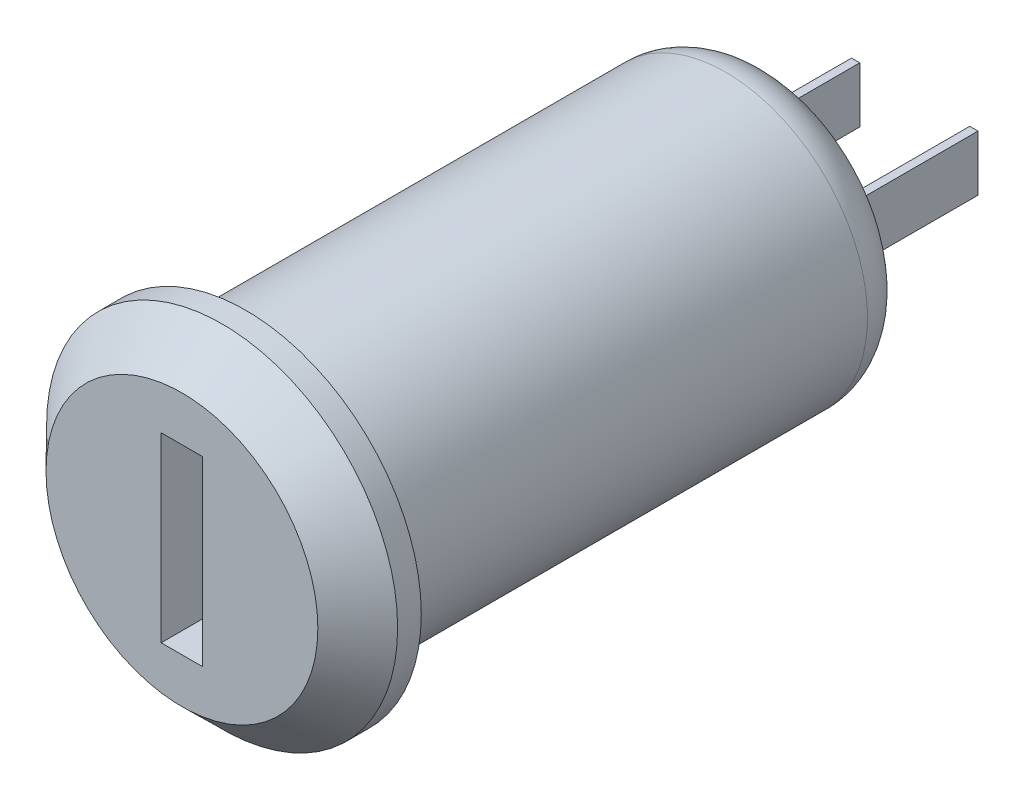
ISO-10303-21;
HEADER;
FILE_DESCRIPTION(('STEP AP214'),'2;1');
FILE_NAME('part.step','',(''),(''),'','','');
FILE_SCHEMA(('AUTOMOTIVE_DESIGN { 1 0 10303 214 1 1 1 1 }'));
ENDSEC;
DATA;
#1=APPLICATION_CONTEXT('core data for automotive mechanical design processes');
#2=APPLICATION_PROTOCOL_DEFINITION('international standard','automotive_design',2000,#1);
#3=PRODUCT_CONTEXT('',#1,'mechanical');
#4=PRODUCT('Part','Part','',(#3));
#5=PRODUCT_RELATED_PRODUCT_CATEGORY('part','',(#4));
#6=PRODUCT_DEFINITION_FORMATION('','',#4);
#7=PRODUCT_DEFINITION_CONTEXT('part definition',#1,'design');
#8=PRODUCT_DEFINITION('design','',#6,#7);
#9=PRODUCT_DEFINITION_SHAPE('','',#8);
#10=(LENGTH_UNIT() NAMED_UNIT(*) SI_UNIT(.MILLI.,.METRE.));
#11=(NAMED_UNIT(*) PLANE_ANGLE_UNIT() SI_UNIT($,.RADIAN.));
#12=(NAMED_UNIT(*) SI_UNIT($,.STERADIAN.) SOLID_ANGLE_UNIT());
#13=UNCERTAINTY_MEASURE_WITH_UNIT(LENGTH_MEASURE(1.E-05),#10,'distance_accuracy_value','');
#14=(GEOMETRIC_REPRESENTATION_CONTEXT(3) GLOBAL_UNCERTAINTY_ASSIGNED_CONTEXT((#13)) GLOBAL_UNIT_ASSIGNED_CONTEXT((#10,
#11,#12)) REPRESENTATION_CONTEXT('',''));
#15=CARTESIAN_POINT('',(0.,0.,0.));
#16=DIRECTION('',(0.,0.,1.));
#17=DIRECTION('',(1.,0.,0.));
#18=AXIS2_PLACEMENT_3D('',#15,#16,#17);
#19=CARTESIAN_POINT('',(0.,0.,-21.0665314139874));
#20=DIRECTION('',(0.,0.,-1.));
#21=DIRECTION('',(-1.,0.,0.));
#22=AXIS2_PLACEMENT_3D('',#19,#20,#21);
#23=PLANE('',#22);
#24=CARTESIAN_POINT('',(0.,0.,-21.0665314139874));
#25=DIRECTION('',(0.,0.,-1.));
#26=DIRECTION('',(-1.,0.,0.));
#27=AXIS2_PLACEMENT_3D('',#24,#25,#26);
#28=CIRCLE('',#27,4.);
#29=CARTESIAN_POINT('',(-4.,0.,-21.0665314139874));
#30=VERTEX_POINT('',#29);
#31=EDGE_CURVE('E42',#30,#30,#28,.T.);
#32=ORIENTED_EDGE('',*,*,#31,.T.);
#33=EDGE_LOOP('',(#32));
#34=FACE_BOUND('',#33,.T.);
#35=DIRECTION('',(-1.,0.,0.));
#36=VECTOR('',#35,1.);
#37=CARTESIAN_POINT('',(2.325,-1.175,-21.0665314139874));
#38=LINE('',#37,#36);
#39=CARTESIAN_POINT('',(2.675,-1.175,-21.0665314139874));
#40=VERTEX_POINT('',#39);
#41=CARTESIAN_POINT('',(2.325,-1.175,-21.0665314139874));
#42=VERTEX_POINT('',#41);
#43=EDGE_CURVE('E152',#40,#42,#38,.T.);
#44=ORIENTED_EDGE('',*,*,#43,.F.);
#45=DIRECTION('',(0.,-1.,0.));
#46=VECTOR('',#45,1.);
#47=CARTESIAN_POINT('',(2.675,1.175,-21.0665314139874));
#48=LINE('',#47,#46);
#49=CARTESIAN_POINT('',(2.675,1.175,-21.0665314139874));
#50=VERTEX_POINT('',#49);
#51=EDGE_CURVE('E149',#50,#40,#48,.T.);
#52=ORIENTED_EDGE('',*,*,#51,.F.);
#53=DIRECTION('',(1.,0.,0.));
#54=VECTOR('',#53,1.);
#55=CARTESIAN_POINT('',(2.325,1.175,-21.0665314139874));
#56=LINE('',#55,#54);
#57=CARTESIAN_POINT('',(2.325,1.175,-21.0665314139874));
#58=VERTEX_POINT('',#57);
#59=EDGE_CURVE('E161',#58,#50,#56,.T.);
#60=ORIENTED_EDGE('',*,*,#59,.F.);
#61=DIRECTION('',(0.,1.,0.));
#62=VECTOR('',#61,1.);
#63=CARTESIAN_POINT('',(2.325,1.175,-21.0665314139874));
#64=LINE('',#63,#62);
#65=EDGE_CURVE('E169',#42,#58,#64,.T.);
#66=ORIENTED_EDGE('',*,*,#65,.F.);
#67=EDGE_LOOP('',(#44,#52,#60,#66));
#68=FACE_BOUND('',#67,.T.);
#69=DIRECTION('',(-1.,0.,0.));
#70=VECTOR('',#69,1.);
#71=CARTESIAN_POINT('',(-2.675,-1.175,-21.0665314139874));
#72=LINE('',#71,#70);
#73=CARTESIAN_POINT('',(-2.325,-1.175,-21.0665314139874));
#74=VERTEX_POINT('',#73);
#75=CARTESIAN_POINT('',(-2.675,-1.175,-21.0665314139874));
#76=VERTEX_POINT('',#75);
#77=EDGE_CURVE('E452',#74,#76,#72,.T.);
#78=ORIENTED_EDGE('',*,*,#77,.F.);
#79=DIRECTION('',(0.,-1.,0.));
#80=VECTOR('',#79,1.);
#81=CARTESIAN_POINT('',(-2.325,1.175,-21.0665314139874));
#82=LINE('',#81,#80);
#83=CARTESIAN_POINT('',(-2.325,1.175,-21.0665314139874));
#84=VERTEX_POINT('',#83);
#85=EDGE_CURVE('E147',#84,#74,#82,.T.);
#86=ORIENTED_EDGE('',*,*,#85,.F.);
#87=DIRECTION('',(1.,0.,0.));
#88=VECTOR('',#87,1.);
#89=CARTESIAN_POINT('',(-2.675,1.175,-21.0665314139874));
#90=LINE('',#89,#88);
#91=CARTESIAN_POINT('',(-2.675,1.175,-21.0665314139874));
#92=VERTEX_POINT('',#91);
#93=EDGE_CURVE('E143',#92,#84,#90,.T.);
#94=ORIENTED_EDGE('',*,*,#93,.F.);
#95=DIRECTION('',(0.,1.,0.));
#96=VECTOR('',#95,1.);
#97=CARTESIAN_POINT('',(-2.675,1.175,-21.0665314139874));
#98=LINE('',#97,#96);
#99=EDGE_CURVE('E449',#76,#92,#98,.T.);
#100=ORIENTED_EDGE('',*,*,#99,.F.);
#101=EDGE_LOOP('',(#78,#86,#94,#100));
#102=FACE_BOUND('',#101,.T.);
#103=ADVANCED_FACE('F34',(#34,#68,#102),#23,.T.);
#104=CARTESIAN_POINT('',(0.,0.,3.93346858601262));
#105=DIRECTION('',(0.,0.,1.));
#106=DIRECTION('',(1.,0.,0.));
#107=AXIS2_PLACEMENT_3D('',#104,#105,#106);
#108=PLANE('',#107);
#109=DIRECTION('',(0.,-1.,0.));
#110=VECTOR('',#109,1.);
#111=CARTESIAN_POINT('',(-0.877288836385118,-3.84657412876559,3.93346858601262));
#112=LINE('',#111,#110);
#113=CARTESIAN_POINT('',(-0.877288836385118,3.84657412876559,3.93346858601262));
#114=VERTEX_POINT('',#113);
#115=CARTESIAN_POINT('',(-0.877288836385118,-3.84657412876559,3.93346858601262));
#116=VERTEX_POINT('',#115);
#117=EDGE_CURVE('E180',#114,#116,#112,.T.);
#118=ORIENTED_EDGE('',*,*,#117,.F.);
#119=DIRECTION('',(-1.,0.,0.));
#120=VECTOR('',#119,1.);
#121=CARTESIAN_POINT('',(0.877288836385118,3.84657412876559,3.93346858601262));
#122=LINE('',#121,#120);
#123=CARTESIAN_POINT('',(0.877288836385118,3.84657412876559,3.93346858601262));
#124=VERTEX_POINT('',#123);
#125=EDGE_CURVE('E185',#124,#114,#122,.T.);
#126=ORIENTED_EDGE('',*,*,#125,.F.);
#127=DIRECTION('',(0.,1.,0.));
#128=VECTOR('',#127,1.);
#129=CARTESIAN_POINT('',(0.877288836385118,-3.84657412876559,3.93346858601262));
#130=LINE('',#129,#128);
#131=CARTESIAN_POINT('',(0.877288836385118,-3.84657412876559,3.93346858601262));
#132=VERTEX_POINT('',#131);
#133=EDGE_CURVE('E199',#132,#124,#130,.T.);
#134=ORIENTED_EDGE('',*,*,#133,.F.);
#135=DIRECTION('',(1.,0.,0.));
#136=VECTOR('',#135,1.);
#137=CARTESIAN_POINT('',(0.877288836385118,-3.84657412876559,3.93346858601262));
#138=LINE('',#137,#136);
#139=EDGE_CURVE('E196',#116,#132,#138,.T.);
#140=ORIENTED_EDGE('',*,*,#139,.F.);
#141=EDGE_LOOP('',(#118,#126,#134,#140));
#142=FACE_BOUND('',#141,.T.);
#143=CARTESIAN_POINT('',(0.,0.,3.93346858601262));
#144=DIRECTION('',(0.,0.,-1.));
#145=DIRECTION('',(-1.,0.,0.));
#146=AXIS2_PLACEMENT_3D('',#143,#144,#145);
#147=CIRCLE('',#146,5.75);
#148=CARTESIAN_POINT('',(-5.75,0.,3.93346858601262));
#149=VERTEX_POINT('',#148);
#150=EDGE_CURVE('E221',#149,#149,#147,.T.);
#151=ORIENTED_EDGE('',*,*,#150,.F.);
#152=EDGE_LOOP('',(#151));
#153=FACE_BOUND('',#152,.T.);
#154=ADVANCED_FACE('F237',(#142,#153),#108,.T.);
#155=CARTESIAN_POINT('',(0.,0.,2.23346858601262));
#156=DIRECTION('',(0.,0.,-1.));
#157=DIRECTION('',(-1.,0.,0.));
#158=AXIS2_PLACEMENT_3D('',#155,#156,#157);
#159=CONICAL_SURFACE('',#158,7.425,0.777990891466283);
#160=ORIENTED_EDGE('',*,*,#150,.T.);
#161=EDGE_LOOP('',(#160));
#162=FACE_BOUND('',#161,.T.);
#163=CARTESIAN_POINT('',(0.,0.,2.23346858601262));
#164=DIRECTION('',(0.,0.,-1.));
#165=DIRECTION('',(-1.,0.,0.));
#166=AXIS2_PLACEMENT_3D('',#163,#164,#165);
#167=CIRCLE('',#166,7.425);
#168=CARTESIAN_POINT('',(-7.425,0.,2.23346858601262));
#169=VERTEX_POINT('',#168);
#170=EDGE_CURVE('E218',#169,#169,#167,.T.);
#171=ORIENTED_EDGE('',*,*,#170,.F.);
#172=EDGE_LOOP('',(#171));
#173=FACE_BOUND('',#172,.T.);
#174=ADVANCED_FACE('F242',(#162,#173),#159,.T.);
#175=CARTESIAN_POINT('',(0.,0.,-16.306049864521));
#176=DIRECTION('',(0.,0.,-1.));
#177=DIRECTION('',(-1.,0.,0.));
#178=AXIS2_PLACEMENT_3D('',#175,#176,#177);
#179=CYLINDRICAL_SURFACE('',#178,7.425);
#180=ORIENTED_EDGE('',*,*,#170,.T.);
#181=EDGE_LOOP('',(#180));
#182=FACE_BOUND('',#181,.T.);
#183=CARTESIAN_POINT('',(0.,0.,1.23346858601263));
#184=DIRECTION('',(0.,0.,-1.));
#185=DIRECTION('',(-1.,0.,0.));
#186=AXIS2_PLACEMENT_3D('',#183,#184,#185);
#187=CIRCLE('',#186,7.425);
#188=CARTESIAN_POINT('',(-7.425,0.,1.23346858601263));
#189=VERTEX_POINT('',#188);
#190=EDGE_CURVE('E215',#189,#189,#187,.T.);
#191=ORIENTED_EDGE('',*,*,#190,.F.);
#192=EDGE_LOOP('',(#191));
#193=FACE_BOUND('',#192,.T.);
#194=ADVANCED_FACE('F255',(#182,#193),#179,.T.);
#195=CARTESIAN_POINT('',(-6.,0.,1.23346858601262));
#196=DIRECTION('',(0.,0.,-1.));
#197=DIRECTION('',(-1.,0.,0.));
#198=AXIS2_PLACEMENT_3D('',#195,#196,#197);
#199=PLANE('',#198);
#200=ORIENTED_EDGE('',*,*,#190,.T.);
#201=EDGE_LOOP('',(#200));
#202=FACE_BOUND('',#201,.T.);
#203=CARTESIAN_POINT('',(0.,0.,1.23346858601263));
#204=DIRECTION('',(0.,0.,-1.));
#205=DIRECTION('',(-1.,0.,0.));
#206=AXIS2_PLACEMENT_3D('',#203,#204,#205);
#207=CIRCLE('',#206,6.);
#208=CARTESIAN_POINT('',(-6.,0.,1.23346858601263));
#209=VERTEX_POINT('',#208);
#210=EDGE_CURVE('E206',#209,#209,#207,.T.);
#211=ORIENTED_EDGE('',*,*,#210,.F.);
#212=EDGE_LOOP('',(#211));
#213=FACE_BOUND('',#212,.T.);
#214=ADVANCED_FACE('F251',(#202,#213),#199,.T.);
#215=CARTESIAN_POINT('',(0.,0.,-16.306049864521));
#216=DIRECTION('',(0.,0.,-1.));
#217=DIRECTION('',(-1.,0.,0.));
#218=AXIS2_PLACEMENT_3D('',#215,#216,#217);
#219=CYLINDRICAL_SURFACE('',#218,6.);
#220=CARTESIAN_POINT('',(0.,0.,-19.0665314139874));
#221=DIRECTION('',(0.,0.,-1.));
#222=DIRECTION('',(-1.,0.,0.));
#223=AXIS2_PLACEMENT_3D('',#220,#221,#222);
#224=CIRCLE('',#223,6.);
#225=CARTESIAN_POINT('',(-6.,0.,-19.0665314139874));
#226=VERTEX_POINT('',#225);
#227=EDGE_CURVE('E11',#226,#226,#224,.F.);
#228=ORIENTED_EDGE('',*,*,#227,.T.);
#229=EDGE_LOOP('',(#228));
#230=FACE_BOUND('',#229,.T.);
#231=ORIENTED_EDGE('',*,*,#210,.T.);
#232=EDGE_LOOP('',(#231));
#233=FACE_BOUND('',#232,.T.);
#234=ADVANCED_FACE('F248',(#230,#233),#219,.T.);
#235=CARTESIAN_POINT('',(-0.877288836385118,-3.84657412876559,-6.06653141398738));
#236=DIRECTION('',(-1.,0.,0.));
#237=DIRECTION('',(0.,0.,1.));
#238=AXIS2_PLACEMENT_3D('',#235,#236,#237);
#239=PLANE('',#238);
#240=ORIENTED_EDGE('',*,*,#117,.T.);
#241=DIRECTION('',(0.,0.,1.));
#242=VECTOR('',#241,1.);
#243=CARTESIAN_POINT('',(-0.877288836385118,-3.84657412876559,-6.06653141398738));
#244=LINE('',#243,#242);
#245=CARTESIAN_POINT('',(-0.877288836385118,-3.84657412876559,-6.06653141398738));
#246=VERTEX_POINT('',#245);
#247=EDGE_CURVE('E194',#246,#116,#244,.T.);
#248=ORIENTED_EDGE('',*,*,#247,.F.);
#249=DIRECTION('',(0.,-1.,0.));
#250=VECTOR('',#249,1.);
#251=CARTESIAN_POINT('',(-0.877288836385118,-3.84657412876559,-6.06653141398738));
#252=LINE('',#251,#250);
#253=CARTESIAN_POINT('',(-0.877288836385118,3.84657412876559,-6.06653141398738));
#254=VERTEX_POINT('',#253);
#255=EDGE_CURVE('E181',#254,#246,#252,.T.);
#256=ORIENTED_EDGE('',*,*,#255,.F.);
#257=DIRECTION('',(0.,0.,1.));
#258=VECTOR('',#257,1.);
#259=CARTESIAN_POINT('',(-0.877288836385118,3.84657412876559,-6.06653141398738));
#260=LINE('',#259,#258);
#261=EDGE_CURVE('E204',#254,#114,#260,.T.);
#262=ORIENTED_EDGE('',*,*,#261,.T.);
#263=EDGE_LOOP('',(#240,#248,#256,#262));
#264=FACE_BOUND('',#263,.T.);
#265=ADVANCED_FACE('F246',(#264),#239,.F.);
#266=CARTESIAN_POINT('',(0.877288836385118,3.84657412876559,-6.06653141398738));
#267=DIRECTION('',(0.,1.,0.));
#268=DIRECTION('',(0.,0.,1.));
#269=AXIS2_PLACEMENT_3D('',#266,#267,#268);
#270=PLANE('',#269);
#271=ORIENTED_EDGE('',*,*,#125,.T.);
#272=ORIENTED_EDGE('',*,*,#261,.F.);
#273=DIRECTION('',(-1.,0.,0.));
#274=VECTOR('',#273,1.);
#275=CARTESIAN_POINT('',(0.877288836385118,3.84657412876559,-6.06653141398738));
#276=LINE('',#275,#274);
#277=CARTESIAN_POINT('',(0.877288836385118,3.84657412876559,-6.06653141398738));
#278=VERTEX_POINT('',#277);
#279=EDGE_CURVE('E191',#278,#254,#276,.T.);
#280=ORIENTED_EDGE('',*,*,#279,.F.);
#281=DIRECTION('',(0.,0.,1.));
#282=VECTOR('',#281,1.);
#283=CARTESIAN_POINT('',(0.877288836385118,3.84657412876559,-6.06653141398738));
#284=LINE('',#283,#282);
#285=EDGE_CURVE('E207',#278,#124,#284,.T.);
#286=ORIENTED_EDGE('',*,*,#285,.T.);
#287=EDGE_LOOP('',(#271,#272,#280,#286));
#288=FACE_BOUND('',#287,.T.);
#289=ADVANCED_FACE('F293',(#288),#270,.F.);
#290=CARTESIAN_POINT('',(0.877288836385118,-3.84657412876559,-6.06653141398738));
#291=DIRECTION('',(1.,0.,0.));
#292=DIRECTION('',(0.,0.,-1.));
#293=AXIS2_PLACEMENT_3D('',#290,#291,#292);
#294=PLANE('',#293);
#295=ORIENTED_EDGE('',*,*,#133,.T.);
#296=ORIENTED_EDGE('',*,*,#285,.F.);
#297=DIRECTION('',(0.,1.,0.));
#298=VECTOR('',#297,1.);
#299=CARTESIAN_POINT('',(0.877288836385118,-3.84657412876559,-6.06653141398738));
#300=LINE('',#299,#298);
#301=CARTESIAN_POINT('',(0.877288836385118,-3.84657412876559,-6.06653141398738));
#302=VERTEX_POINT('',#301);
#303=EDGE_CURVE('E188',#302,#278,#300,.T.);
#304=ORIENTED_EDGE('',*,*,#303,.F.);
#305=DIRECTION('',(0.,0.,1.));
#306=VECTOR('',#305,1.);
#307=CARTESIAN_POINT('',(0.877288836385118,-3.84657412876559,-6.06653141398738));
#308=LINE('',#307,#306);
#309=EDGE_CURVE('E209',#302,#132,#308,.T.);
#310=ORIENTED_EDGE('',*,*,#309,.T.);
#311=EDGE_LOOP('',(#295,#296,#304,#310));
#312=FACE_BOUND('',#311,.T.);
#313=ADVANCED_FACE('F300',(#312),#294,.F.);
#314=CARTESIAN_POINT('',(0.877288836385118,-3.84657412876559,-6.06653141398738));
#315=DIRECTION('',(0.,-1.,0.));
#316=DIRECTION('',(0.,0.,-1.));
#317=AXIS2_PLACEMENT_3D('',#314,#315,#316);
#318=PLANE('',#317);
#319=ORIENTED_EDGE('',*,*,#139,.T.);
#320=ORIENTED_EDGE('',*,*,#309,.F.);
#321=DIRECTION('',(1.,0.,0.));
#322=VECTOR('',#321,1.);
#323=CARTESIAN_POINT('',(0.877288836385118,-3.84657412876559,-6.06653141398738));
#324=LINE('',#323,#322);
#325=EDGE_CURVE('E184',#246,#302,#324,.T.);
#326=ORIENTED_EDGE('',*,*,#325,.F.);
#327=ORIENTED_EDGE('',*,*,#247,.T.);
#328=EDGE_LOOP('',(#319,#320,#326,#327));
#329=FACE_BOUND('',#328,.T.);
#330=ADVANCED_FACE('F308',(#329),#318,.F.);
#331=CARTESIAN_POINT('',(0.,0.,-6.06653141398738));
#332=DIRECTION('',(0.,0.,1.));
#333=DIRECTION('',(1.,0.,0.));
#334=AXIS2_PLACEMENT_3D('',#331,#332,#333);
#335=PLANE('',#334);
#336=ORIENTED_EDGE('',*,*,#255,.T.);
#337=ORIENTED_EDGE('',*,*,#325,.T.);
#338=ORIENTED_EDGE('',*,*,#303,.T.);
#339=ORIENTED_EDGE('',*,*,#279,.T.);
#340=EDGE_LOOP('',(#336,#337,#338,#339));
#341=FACE_BOUND('',#340,.T.);
#342=ADVANCED_FACE('F316',(#341),#335,.T.);
#343=CARTESIAN_POINT('',(2.675,1.175,-27.0665314139874));
#344=DIRECTION('',(-1.,0.,0.));
#345=DIRECTION('',(0.,-1.,0.));
#346=AXIS2_PLACEMENT_3D('',#343,#344,#345);
#347=PLANE('',#346);
#348=ORIENTED_EDGE('',*,*,#51,.T.);
#349=DIRECTION('',(0.,0.,1.));
#350=VECTOR('',#349,1.);
#351=CARTESIAN_POINT('',(2.675,-1.175,-27.0665314139874));
#352=LINE('',#351,#350);
#353=CARTESIAN_POINT('',(2.675,-1.175,-27.0665314139874));
#354=VERTEX_POINT('',#353);
#355=EDGE_CURVE('E178',#354,#40,#352,.T.);
#356=ORIENTED_EDGE('',*,*,#355,.F.);
#357=DIRECTION('',(0.,-1.,0.));
#358=VECTOR('',#357,1.);
#359=CARTESIAN_POINT('',(2.675,1.175,-27.0665314139874));
#360=LINE('',#359,#358);
#361=CARTESIAN_POINT('',(2.675,1.175,-27.0665314139874));
#362=VERTEX_POINT('',#361);
#363=EDGE_CURVE('E157',#362,#354,#360,.T.);
#364=ORIENTED_EDGE('',*,*,#363,.F.);
#365=DIRECTION('',(0.,0.,1.));
#366=VECTOR('',#365,1.);
#367=CARTESIAN_POINT('',(2.675,1.175,-27.0665314139874));
#368=LINE('',#367,#366);
#369=EDGE_CURVE('E166',#362,#50,#368,.T.);
#370=ORIENTED_EDGE('',*,*,#369,.T.);
#371=EDGE_LOOP('',(#348,#356,#364,#370));
#372=FACE_BOUND('',#371,.T.);
#373=ADVANCED_FACE('F323',(#372),#347,.F.);
#374=CARTESIAN_POINT('',(2.325,-1.175,-27.0665314139874));
#375=DIRECTION('',(0.,1.,0.));
#376=DIRECTION('',(-1.,0.,0.));
#377=AXIS2_PLACEMENT_3D('',#374,#375,#376);
#378=PLANE('',#377);
#379=ORIENTED_EDGE('',*,*,#43,.T.);
#380=DIRECTION('',(0.,0.,1.));
#381=VECTOR('',#380,1.);
#382=CARTESIAN_POINT('',(2.325,-1.175,-27.0665314139874));
#383=LINE('',#382,#381);
#384=CARTESIAN_POINT('',(2.325,-1.175,-27.0665314139874));
#385=VERTEX_POINT('',#384);
#386=EDGE_CURVE('E175',#385,#42,#383,.T.);
#387=ORIENTED_EDGE('',*,*,#386,.F.);
#388=DIRECTION('',(-1.,0.,0.));
#389=VECTOR('',#388,1.);
#390=CARTESIAN_POINT('',(2.325,-1.175,-27.0665314139874));
#391=LINE('',#390,#389);
#392=EDGE_CURVE('E160',#354,#385,#391,.T.);
#393=ORIENTED_EDGE('',*,*,#392,.F.);
#394=ORIENTED_EDGE('',*,*,#355,.T.);
#395=EDGE_LOOP('',(#379,#387,#393,#394));
#396=FACE_BOUND('',#395,.T.);
#397=ADVANCED_FACE('F331',(#396),#378,.F.);
#398=CARTESIAN_POINT('',(2.325,1.175,-27.0665314139874));
#399=DIRECTION('',(1.,0.,0.));
#400=DIRECTION('',(0.,1.,0.));
#401=AXIS2_PLACEMENT_3D('',#398,#399,#400);
#402=PLANE('',#401);
#403=ORIENTED_EDGE('',*,*,#65,.T.);
#404=DIRECTION('',(0.,0.,1.));
#405=VECTOR('',#404,1.);
#406=CARTESIAN_POINT('',(2.325,1.175,-27.0665314139874));
#407=LINE('',#406,#405);
#408=CARTESIAN_POINT('',(2.325,1.175,-27.0665314139874));
#409=VERTEX_POINT('',#408);
#410=EDGE_CURVE('E57',#409,#58,#407,.T.);
#411=ORIENTED_EDGE('',*,*,#410,.F.);
#412=DIRECTION('',(0.,1.,0.));
#413=VECTOR('',#412,1.);
#414=CARTESIAN_POINT('',(2.325,1.175,-27.0665314139874));
#415=LINE('',#414,#413);
#416=EDGE_CURVE('E163',#385,#409,#415,.T.);
#417=ORIENTED_EDGE('',*,*,#416,.F.);
#418=ORIENTED_EDGE('',*,*,#386,.T.);
#419=EDGE_LOOP('',(#403,#411,#417,#418));
#420=FACE_BOUND('',#419,.T.);
#421=ADVANCED_FACE('F339',(#420),#402,.F.);
#422=CARTESIAN_POINT('',(2.325,1.175,-27.0665314139874));
#423=DIRECTION('',(0.,-1.,0.));
#424=DIRECTION('',(0.,0.,-1.));
#425=AXIS2_PLACEMENT_3D('',#422,#423,#424);
#426=PLANE('',#425);
#427=ORIENTED_EDGE('',*,*,#59,.T.);
#428=ORIENTED_EDGE('',*,*,#369,.F.);
#429=DIRECTION('',(1.,0.,0.));
#430=VECTOR('',#429,1.);
#431=CARTESIAN_POINT('',(2.325,1.175,-27.0665314139874));
#432=LINE('',#431,#430);
#433=EDGE_CURVE('E165',#409,#362,#432,.T.);
#434=ORIENTED_EDGE('',*,*,#433,.F.);
#435=ORIENTED_EDGE('',*,*,#410,.T.);
#436=EDGE_LOOP('',(#427,#428,#434,#435));
#437=FACE_BOUND('',#436,.T.);
#438=ADVANCED_FACE('F347',(#437),#426,.F.);
#439=CARTESIAN_POINT('',(0.,0.,-27.0665314139874));
#440=DIRECTION('',(0.,0.,1.));
#441=DIRECTION('',(1.,0.,0.));
#442=AXIS2_PLACEMENT_3D('',#439,#440,#441);
#443=PLANE('',#442);
#444=ORIENTED_EDGE('',*,*,#363,.T.);
#445=ORIENTED_EDGE('',*,*,#392,.T.);
#446=ORIENTED_EDGE('',*,*,#416,.T.);
#447=ORIENTED_EDGE('',*,*,#433,.T.);
#448=EDGE_LOOP('',(#444,#445,#446,#447));
#449=FACE_BOUND('',#448,.T.);
#450=ADVANCED_FACE('F355',(#449),#443,.F.);
#451=CARTESIAN_POINT('',(-2.325,1.175,-27.0665314139874));
#452=DIRECTION('',(-1.,0.,0.));
#453=DIRECTION('',(0.,-1.,0.));
#454=AXIS2_PLACEMENT_3D('',#451,#452,#453);
#455=PLANE('',#454);
#456=ORIENTED_EDGE('',*,*,#85,.T.);
#457=DIRECTION('',(0.,0.,1.));
#458=VECTOR('',#457,1.);
#459=CARTESIAN_POINT('',(-2.325,-1.175,-27.0665314139874));
#460=LINE('',#459,#458);
#461=CARTESIAN_POINT('',(-2.325,-1.175,-27.0665314139874));
#462=VERTEX_POINT('',#461);
#463=EDGE_CURVE('E128',#462,#74,#460,.T.);
#464=ORIENTED_EDGE('',*,*,#463,.F.);
#465=DIRECTION('',(0.,-1.,0.));
#466=VECTOR('',#465,1.);
#467=CARTESIAN_POINT('',(-2.325,1.175,-27.0665314139874));
#468=LINE('',#467,#466);
#469=CARTESIAN_POINT('',(-2.325,1.175,-27.0665314139874));
#470=VERTEX_POINT('',#469);
#471=EDGE_CURVE('E135',#470,#462,#468,.T.);
#472=ORIENTED_EDGE('',*,*,#471,.F.);
#473=DIRECTION('',(0.,0.,1.));
#474=VECTOR('',#473,1.);
#475=CARTESIAN_POINT('',(-2.325,1.175,-27.0665314139874));
#476=LINE('',#475,#474);
#477=EDGE_CURVE('E446',#470,#84,#476,.T.);
#478=ORIENTED_EDGE('',*,*,#477,.T.);
#479=EDGE_LOOP('',(#456,#464,#472,#478));
#480=FACE_BOUND('',#479,.T.);
#481=ADVANCED_FACE('F145',(#480),#455,.F.);
#482=CARTESIAN_POINT('',(-2.675,-1.175,-27.0665314139874));
#483=DIRECTION('',(0.,1.,0.));
#484=DIRECTION('',(-1.,0.,0.));
#485=AXIS2_PLACEMENT_3D('',#482,#483,#484);
#486=PLANE('',#485);
#487=ORIENTED_EDGE('',*,*,#77,.T.);
#488=DIRECTION('',(0.,0.,1.));
#489=VECTOR('',#488,1.);
#490=CARTESIAN_POINT('',(-2.675,-1.175,-27.0665314139874));
#491=LINE('',#490,#489);
#492=CARTESIAN_POINT('',(-2.675,-1.175,-27.0665314139874));
#493=VERTEX_POINT('',#492);
#494=EDGE_CURVE('E131',#493,#76,#491,.T.);
#495=ORIENTED_EDGE('',*,*,#494,.F.);
#496=DIRECTION('',(-1.,0.,0.));
#497=VECTOR('',#496,1.);
#498=CARTESIAN_POINT('',(-2.675,-1.175,-27.0665314139874));
#499=LINE('',#498,#497);
#500=EDGE_CURVE('E124',#462,#493,#499,.T.);
#501=ORIENTED_EDGE('',*,*,#500,.F.);
#502=ORIENTED_EDGE('',*,*,#463,.T.);
#503=EDGE_LOOP('',(#487,#495,#501,#502));
#504=FACE_BOUND('',#503,.T.);
#505=ADVANCED_FACE('F126',(#504),#486,.F.);
#506=CARTESIAN_POINT('',(-2.675,1.175,-27.0665314139874));
#507=DIRECTION('',(1.,0.,0.));
#508=DIRECTION('',(0.,1.,0.));
#509=AXIS2_PLACEMENT_3D('',#506,#507,#508);
#510=PLANE('',#509);
#511=ORIENTED_EDGE('',*,*,#99,.T.);
#512=DIRECTION('',(0.,0.,1.));
#513=VECTOR('',#512,1.);
#514=CARTESIAN_POINT('',(-2.675,1.175,-27.0665314139874));
#515=LINE('',#514,#513);
#516=CARTESIAN_POINT('',(-2.675,1.175,-27.0665314139874));
#517=VERTEX_POINT('',#516);
#518=EDGE_CURVE('E49',#517,#92,#515,.T.);
#519=ORIENTED_EDGE('',*,*,#518,.F.);
#520=DIRECTION('',(0.,1.,0.));
#521=VECTOR('',#520,1.);
#522=CARTESIAN_POINT('',(-2.675,1.175,-27.0665314139874));
#523=LINE('',#522,#521);
#524=EDGE_CURVE('E134',#493,#517,#523,.T.);
#525=ORIENTED_EDGE('',*,*,#524,.F.);
#526=ORIENTED_EDGE('',*,*,#494,.T.);
#527=EDGE_LOOP('',(#511,#519,#525,#526));
#528=FACE_BOUND('',#527,.T.);
#529=ADVANCED_FACE('F375',(#528),#510,.F.);
#530=CARTESIAN_POINT('',(-2.675,1.175,-27.0665314139874));
#531=DIRECTION('',(0.,-1.,0.));
#532=DIRECTION('',(1.,0.,0.));
#533=AXIS2_PLACEMENT_3D('',#530,#531,#532);
#534=PLANE('',#533);
#535=ORIENTED_EDGE('',*,*,#93,.T.);
#536=ORIENTED_EDGE('',*,*,#477,.F.);
#537=DIRECTION('',(1.,0.,0.));
#538=VECTOR('',#537,1.);
#539=CARTESIAN_POINT('',(-2.675,1.175,-27.0665314139874));
#540=LINE('',#539,#538);
#541=EDGE_CURVE('E139',#517,#470,#540,.T.);
#542=ORIENTED_EDGE('',*,*,#541,.F.);
#543=ORIENTED_EDGE('',*,*,#518,.T.);
#544=EDGE_LOOP('',(#535,#536,#542,#543));
#545=FACE_BOUND('',#544,.T.);
#546=ADVANCED_FACE('F233',(#545),#534,.F.);
#547=CARTESIAN_POINT('',(0.,0.,-27.0665314139874));
#548=DIRECTION('',(0.,0.,1.));
#549=DIRECTION('',(1.,0.,0.));
#550=AXIS2_PLACEMENT_3D('',#547,#548,#549);
#551=PLANE('',#550);
#552=ORIENTED_EDGE('',*,*,#471,.T.);
#553=ORIENTED_EDGE('',*,*,#500,.T.);
#554=ORIENTED_EDGE('',*,*,#524,.T.);
#555=ORIENTED_EDGE('',*,*,#541,.T.);
#556=EDGE_LOOP('',(#552,#553,#554,#555));
#557=FACE_BOUND('',#556,.T.);
#558=ADVANCED_FACE('F138',(#557),#551,.F.);
#559=CARTESIAN_POINT('',(0.,0.,-19.0665314139874));
#560=DIRECTION('',(0.,0.,-1.));
#561=DIRECTION('',(-1.,0.,0.));
#562=AXIS2_PLACEMENT_3D('',#559,#560,#561);
#563=TOROIDAL_SURFACE('',#562,4.,2.);
#564=ORIENTED_EDGE('',*,*,#227,.F.);
#565=EDGE_LOOP('',(#564));
#566=FACE_BOUND('',#565,.T.);
#567=ORIENTED_EDGE('',*,*,#31,.F.);
#568=EDGE_LOOP('',(#567));
#569=FACE_BOUND('',#568,.T.);
#570=ADVANCED_FACE('F36',(#566,#569),#563,.T.);
#571=CLOSED_SHELL('',(#103,#154,#174,#194,#214,#234,#265,#289,#313,#330,#342,#373,#397,#421,
#438,#450,#481,#505,#529,#546,#558,#570));
#572=MANIFOLD_SOLID_BREP('B2',#571);
#573=ADVANCED_BREP_SHAPE_REPRESENTATION('',(#18,#572),#14);
#574=SHAPE_DEFINITION_REPRESENTATION(#9,#573);
ENDSEC;
END-ISO-10303-21;
